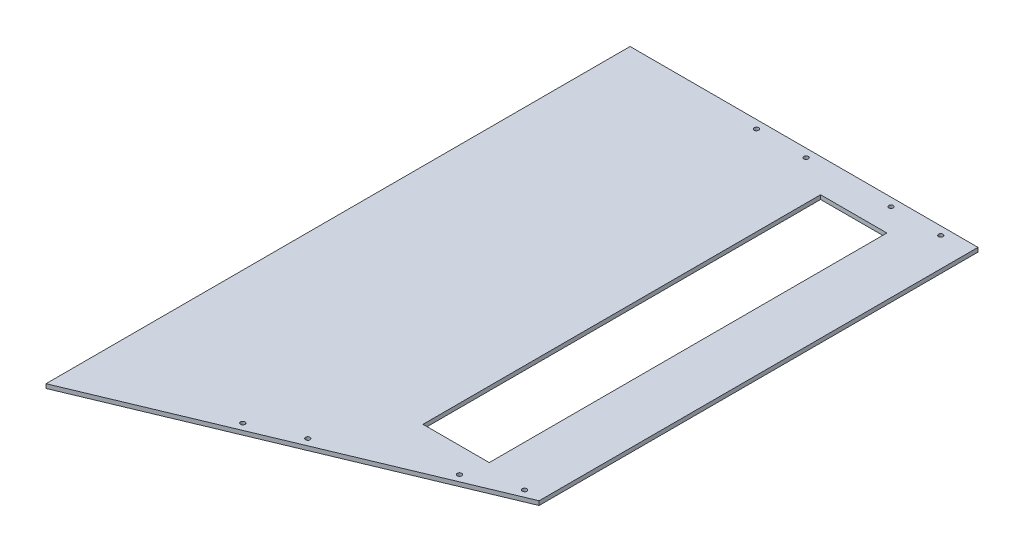
ISO-10303-21;
HEADER;
FILE_DESCRIPTION(('STEP AP214'),'2;1');
FILE_NAME('part.step','',(''),(''),'','','');
FILE_SCHEMA(('AUTOMOTIVE_DESIGN { 1 0 10303 214 1 1 1 1 }'));
ENDSEC;
DATA;
#1=APPLICATION_CONTEXT('core data for automotive mechanical design processes');
#2=APPLICATION_PROTOCOL_DEFINITION('international standard','automotive_design',2000,#1);
#3=PRODUCT_CONTEXT('',#1,'mechanical');
#4=PRODUCT('Part','Part','',(#3));
#5=PRODUCT_RELATED_PRODUCT_CATEGORY('part','',(#4));
#6=PRODUCT_DEFINITION_FORMATION('','',#4);
#7=PRODUCT_DEFINITION_CONTEXT('part definition',#1,'design');
#8=PRODUCT_DEFINITION('design','',#6,#7);
#9=PRODUCT_DEFINITION_SHAPE('','',#8);
#10=(LENGTH_UNIT() NAMED_UNIT(*) SI_UNIT(.MILLI.,.METRE.));
#11=(NAMED_UNIT(*) PLANE_ANGLE_UNIT() SI_UNIT($,.RADIAN.));
#12=(NAMED_UNIT(*) SI_UNIT($,.STERADIAN.) SOLID_ANGLE_UNIT());
#13=UNCERTAINTY_MEASURE_WITH_UNIT(LENGTH_MEASURE(1.E-05),#10,'distance_accuracy_value','');
#14=(GEOMETRIC_REPRESENTATION_CONTEXT(3) GLOBAL_UNCERTAINTY_ASSIGNED_CONTEXT((#13)) GLOBAL_UNIT_ASSIGNED_CONTEXT((#10,
#11,#12)) REPRESENTATION_CONTEXT('',''));
#15=CARTESIAN_POINT('',(0.,0.,0.));
#16=DIRECTION('',(0.,0.,1.));
#17=DIRECTION('',(1.,0.,0.));
#18=AXIS2_PLACEMENT_3D('',#15,#16,#17);
#19=CARTESIAN_POINT('',(0.,-6.35,831.85));
#20=DIRECTION('',(0.,1.,0.));
#21=DIRECTION('',(0.,0.,1.));
#22=AXIS2_PLACEMENT_3D('',#19,#20,#21);
#23=PLANE('',#22);
#24=DIRECTION('',(1.,0.,0.));
#25=VECTOR('',#24,1.);
#26=CARTESIAN_POINT('',(292.1,-6.35,660.4));
#27=LINE('',#26,#25);
#28=CARTESIAN_POINT('',(190.5,-6.35,660.4));
#29=VERTEX_POINT('',#28);
#30=CARTESIAN_POINT('',(292.1,-6.35,660.4));
#31=VERTEX_POINT('',#30);
#32=EDGE_CURVE('E153',#29,#31,#27,.T.);
#33=ORIENTED_EDGE('',*,*,#32,.T.);
#34=DIRECTION('',(0.,0.,-1.));
#35=VECTOR('',#34,1.);
#36=CARTESIAN_POINT('',(292.1,-6.35,50.8));
#37=LINE('',#36,#35);
#38=CARTESIAN_POINT('',(292.1,-6.35,50.8));
#39=VERTEX_POINT('',#38);
#40=EDGE_CURVE('E145',#31,#39,#37,.T.);
#41=ORIENTED_EDGE('',*,*,#40,.T.);
#42=DIRECTION('',(-1.,0.,0.));
#43=VECTOR('',#42,1.);
#44=CARTESIAN_POINT('',(292.1,-6.35,50.8));
#45=LINE('',#44,#43);
#46=CARTESIAN_POINT('',(190.5,-6.35,50.8));
#47=VERTEX_POINT('',#46);
#48=EDGE_CURVE('E148',#39,#47,#45,.T.);
#49=ORIENTED_EDGE('',*,*,#48,.T.);
#50=DIRECTION('',(0.,0.,1.));
#51=VECTOR('',#50,1.);
#52=CARTESIAN_POINT('',(190.5,-6.35,50.8));
#53=LINE('',#52,#51);
#54=EDGE_CURVE('E67',#47,#29,#53,.T.);
#55=ORIENTED_EDGE('',*,*,#54,.T.);
#56=EDGE_LOOP('',(#33,#41,#49,#55));
#57=FACE_BOUND('',#56,.T.);
#58=CARTESIAN_POINT('',(50.8,-6.35,796.892712953548));
#59=DIRECTION('',(0.,1.,0.));
#60=DIRECTION('',(0.,0.,1.));
#61=AXIS2_PLACEMENT_3D('',#58,#59,#60);
#62=CIRCLE('',#61,3.42899999999999);
#63=CARTESIAN_POINT('',(50.8,-6.35,800.321712953548));
#64=VERTEX_POINT('',#63);
#65=EDGE_CURVE('E174',#64,#64,#62,.T.);
#66=ORIENTED_EDGE('',*,*,#65,.T.);
#67=EDGE_LOOP('',(#66));
#68=FACE_BOUND('',#67,.T.);
#69=CARTESIAN_POINT('',(336.55,-6.35,12.7));
#70=DIRECTION('',(0.,1.,0.));
#71=DIRECTION('',(0.,0.,1.));
#72=AXIS2_PLACEMENT_3D('',#69,#70,#71);
#73=CIRCLE('',#72,3.429);
#74=CARTESIAN_POINT('',(336.55,-6.35,16.129));
#75=VERTEX_POINT('',#74);
#76=EDGE_CURVE('E182',#75,#75,#73,.T.);
#77=ORIENTED_EDGE('',*,*,#76,.T.);
#78=EDGE_LOOP('',(#77));
#79=FACE_BOUND('',#78,.T.);
#80=CARTESIAN_POINT('',(260.35,-6.35,12.7));
#81=DIRECTION('',(0.,1.,0.));
#82=DIRECTION('',(0.,0.,1.));
#83=AXIS2_PLACEMENT_3D('',#80,#81,#82);
#84=CIRCLE('',#83,3.429);
#85=CARTESIAN_POINT('',(260.35,-6.35,16.129));
#86=VERTEX_POINT('',#85);
#87=EDGE_CURVE('E205',#86,#86,#84,.T.);
#88=ORIENTED_EDGE('',*,*,#87,.T.);
#89=EDGE_LOOP('',(#88));
#90=FACE_BOUND('',#89,.T.);
#91=CARTESIAN_POINT('',(355.537234944741,-6.35,669.742181542022));
#92=DIRECTION('',(0.,1.,0.));
#93=DIRECTION('',(0.,0.,1.));
#94=AXIS2_PLACEMENT_3D('',#91,#92,#93);
#95=CIRCLE('',#94,3.429);
#96=CARTESIAN_POINT('',(355.537234944741,-6.35,673.171181542022));
#97=VERTEX_POINT('',#96);
#98=EDGE_CURVE('E199',#97,#97,#95,.T.);
#99=ORIENTED_EDGE('',*,*,#98,.T.);
#100=EDGE_LOOP('',(#99));
#101=FACE_BOUND('',#100,.T.);
#102=CARTESIAN_POINT('',(285.213257649801,-6.35,699.084611867759));
#103=DIRECTION('',(0.,1.,0.));
#104=DIRECTION('',(0.,0.,1.));
#105=AXIS2_PLACEMENT_3D('',#102,#103,#104);
#106=CIRCLE('',#105,3.429);
#107=CARTESIAN_POINT('',(285.213257649801,-6.35,702.513611867759));
#108=VERTEX_POINT('',#107);
#109=EDGE_CURVE('E193',#108,#108,#106,.T.);
#110=ORIENTED_EDGE('',*,*,#109,.T.);
#111=EDGE_LOOP('',(#110));
#112=FACE_BOUND('',#111,.T.);
#113=CARTESIAN_POINT('',(121.12397729494,-6.35,767.550282627811));
#114=DIRECTION('',(0.,1.,0.));
#115=DIRECTION('',(0.,0.,1.));
#116=AXIS2_PLACEMENT_3D('',#113,#114,#115);
#117=CIRCLE('',#116,3.429);
#118=CARTESIAN_POINT('',(121.12397729494,-6.35,770.979282627811));
#119=VERTEX_POINT('',#118);
#120=EDGE_CURVE('E181',#119,#119,#117,.T.);
#121=ORIENTED_EDGE('',*,*,#120,.T.);
#122=EDGE_LOOP('',(#121));
#123=FACE_BOUND('',#122,.T.);
#124=CARTESIAN_POINT('',(130.175,-6.35,12.7));
#125=DIRECTION('',(0.,1.,0.));
#126=DIRECTION('',(0.,0.,1.));
#127=AXIS2_PLACEMENT_3D('',#124,#125,#126);
#128=CIRCLE('',#127,3.429);
#129=CARTESIAN_POINT('',(130.175,-6.35,16.129));
#130=VERTEX_POINT('',#129);
#131=EDGE_CURVE('E210',#130,#130,#128,.T.);
#132=ORIENTED_EDGE('',*,*,#131,.T.);
#133=EDGE_LOOP('',(#132));
#134=FACE_BOUND('',#133,.T.);
#135=CARTESIAN_POINT('',(53.975,-6.35,12.7));
#136=DIRECTION('',(0.,1.,0.));
#137=DIRECTION('',(0.,0.,1.));
#138=AXIS2_PLACEMENT_3D('',#135,#136,#137);
#139=CIRCLE('',#138,3.429);
#140=CARTESIAN_POINT('',(53.975,-6.35,16.129));
#141=VERTEX_POINT('',#140);
#142=EDGE_CURVE('E216',#141,#141,#139,.T.);
#143=ORIENTED_EDGE('',*,*,#142,.T.);
#144=EDGE_LOOP('',(#143));
#145=FACE_BOUND('',#144,.T.);
#146=DIRECTION('',(-0.92288684114095,0.,0.38507126411728));
#147=VECTOR('',#146,1.);
#148=CARTESIAN_POINT('',(381.,-6.35,672.879100114478));
#149=LINE('',#148,#147);
#150=CARTESIAN_POINT('',(381.,-6.35,672.879100114478));
#151=VERTEX_POINT('',#150);
#152=CARTESIAN_POINT('',(-152.4,-6.35,895.438359954209));
#153=VERTEX_POINT('',#152);
#154=EDGE_CURVE('E139',#151,#153,#149,.T.);
#155=ORIENTED_EDGE('',*,*,#154,.T.);
#156=DIRECTION('',(0.,0.,1.));
#157=VECTOR('',#156,1.);
#158=CARTESIAN_POINT('',(-152.4,-6.35,895.438359954209));
#159=LINE('',#158,#157);
#160=CARTESIAN_POINT('',(-152.4,-6.35,0.));
#161=VERTEX_POINT('',#160);
#162=EDGE_CURVE('E134',#161,#153,#159,.T.);
#163=ORIENTED_EDGE('',*,*,#162,.F.);
#164=DIRECTION('',(1.,0.,0.));
#165=VECTOR('',#164,1.);
#166=CARTESIAN_POINT('',(0.,-6.35,0.));
#167=LINE('',#166,#165);
#168=CARTESIAN_POINT('',(381.,-6.35,0.));
#169=VERTEX_POINT('',#168);
#170=EDGE_CURVE('E117',#161,#169,#167,.T.);
#171=ORIENTED_EDGE('',*,*,#170,.T.);
#172=DIRECTION('',(0.,0.,-1.));
#173=VECTOR('',#172,1.);
#174=CARTESIAN_POINT('',(381.,-6.35,831.85));
#175=LINE('',#174,#173);
#176=EDGE_CURVE('E13',#151,#169,#175,.T.);
#177=ORIENTED_EDGE('',*,*,#176,.F.);
#178=EDGE_LOOP('',(#155,#163,#171,#177));
#179=FACE_BOUND('',#178,.T.);
#180=ADVANCED_FACE('F53',(#57,#68,#79,#90,#101,#112,#123,#134,#145,#179),#23,.F.);
#181=CARTESIAN_POINT('',(381.,0.,831.85));
#182=DIRECTION('',(1.,0.,0.));
#183=DIRECTION('',(0.,0.,-1.));
#184=AXIS2_PLACEMENT_3D('',#181,#182,#183);
#185=PLANE('',#184);
#186=DIRECTION('',(0.,0.,-1.));
#187=VECTOR('',#186,1.);
#188=CARTESIAN_POINT('',(381.,0.,831.85));
#189=LINE('',#188,#187);
#190=CARTESIAN_POINT('',(381.,0.,672.879100114478));
#191=VERTEX_POINT('',#190);
#192=CARTESIAN_POINT('',(381.,0.,0.));
#193=VERTEX_POINT('',#192);
#194=EDGE_CURVE('E60',#191,#193,#189,.T.);
#195=ORIENTED_EDGE('',*,*,#194,.F.);
#196=DIRECTION('',(0.,-1.,0.));
#197=VECTOR('',#196,1.);
#198=CARTESIAN_POINT('',(381.,1.2E-05,672.879100114478));
#199=LINE('',#198,#197);
#200=EDGE_CURVE('E222',#191,#151,#199,.T.);
#201=ORIENTED_EDGE('',*,*,#200,.T.);
#202=ORIENTED_EDGE('',*,*,#176,.T.);
#203=DIRECTION('',(0.,-1.,0.));
#204=VECTOR('',#203,1.);
#205=CARTESIAN_POINT('',(381.,0.,0.));
#206=LINE('',#205,#204);
#207=EDGE_CURVE('E124',#193,#169,#206,.T.);
#208=ORIENTED_EDGE('',*,*,#207,.F.);
#209=EDGE_LOOP('',(#195,#201,#202,#208));
#210=FACE_BOUND('',#209,.T.);
#211=ADVANCED_FACE('F235',(#210),#185,.T.);
#212=CARTESIAN_POINT('',(0.,0.,831.85));
#213=DIRECTION('',(0.,1.,0.));
#214=DIRECTION('',(0.,0.,1.));
#215=AXIS2_PLACEMENT_3D('',#212,#213,#214);
#216=PLANE('',#215);
#217=DIRECTION('',(0.,0.,-1.));
#218=VECTOR('',#217,1.);
#219=CARTESIAN_POINT('',(292.1,0.,50.8));
#220=LINE('',#219,#218);
#221=CARTESIAN_POINT('',(292.1,0.,660.4));
#222=VERTEX_POINT('',#221);
#223=CARTESIAN_POINT('',(292.1,0.,50.8));
#224=VERTEX_POINT('',#223);
#225=EDGE_CURVE('E75',#222,#224,#220,.T.);
#226=ORIENTED_EDGE('',*,*,#225,.F.);
#227=DIRECTION('',(1.,0.,0.));
#228=VECTOR('',#227,1.);
#229=CARTESIAN_POINT('',(292.1,0.,660.4));
#230=LINE('',#229,#228);
#231=CARTESIAN_POINT('',(190.5,0.,660.4));
#232=VERTEX_POINT('',#231);
#233=EDGE_CURVE('E149',#232,#222,#230,.T.);
#234=ORIENTED_EDGE('',*,*,#233,.F.);
#235=DIRECTION('',(0.,0.,1.));
#236=VECTOR('',#235,1.);
#237=CARTESIAN_POINT('',(190.5,0.,50.8));
#238=LINE('',#237,#236);
#239=CARTESIAN_POINT('',(190.5,0.,50.8));
#240=VERTEX_POINT('',#239);
#241=EDGE_CURVE('E161',#240,#232,#238,.T.);
#242=ORIENTED_EDGE('',*,*,#241,.F.);
#243=DIRECTION('',(-1.,0.,0.));
#244=VECTOR('',#243,1.);
#245=CARTESIAN_POINT('',(292.1,0.,50.8));
#246=LINE('',#245,#244);
#247=EDGE_CURVE('E158',#224,#240,#246,.T.);
#248=ORIENTED_EDGE('',*,*,#247,.F.);
#249=EDGE_LOOP('',(#226,#234,#242,#248));
#250=FACE_BOUND('',#249,.T.);
#251=CARTESIAN_POINT('',(50.8,0.,796.892712953548));
#252=DIRECTION('',(0.,1.,0.));
#253=DIRECTION('',(0.,0.,1.));
#254=AXIS2_PLACEMENT_3D('',#251,#252,#253);
#255=CIRCLE('',#254,3.42899999999999);
#256=CARTESIAN_POINT('',(50.8,0.,800.321712953548));
#257=VERTEX_POINT('',#256);
#258=EDGE_CURVE('E178',#257,#257,#255,.T.);
#259=ORIENTED_EDGE('',*,*,#258,.F.);
#260=EDGE_LOOP('',(#259));
#261=FACE_BOUND('',#260,.T.);
#262=CARTESIAN_POINT('',(336.55,0.,12.7));
#263=DIRECTION('',(0.,1.,0.));
#264=DIRECTION('',(0.,0.,1.));
#265=AXIS2_PLACEMENT_3D('',#262,#263,#264);
#266=CIRCLE('',#265,3.429);
#267=CARTESIAN_POINT('',(336.55,0.,16.129));
#268=VERTEX_POINT('',#267);
#269=EDGE_CURVE('E168',#268,#268,#266,.T.);
#270=ORIENTED_EDGE('',*,*,#269,.F.);
#271=EDGE_LOOP('',(#270));
#272=FACE_BOUND('',#271,.T.);
#273=CARTESIAN_POINT('',(260.35,0.,12.7));
#274=DIRECTION('',(0.,1.,0.));
#275=DIRECTION('',(0.,0.,1.));
#276=AXIS2_PLACEMENT_3D('',#273,#274,#275);
#277=CIRCLE('',#276,3.429);
#278=CARTESIAN_POINT('',(260.35,0.,16.129));
#279=VERTEX_POINT('',#278);
#280=EDGE_CURVE('E185',#279,#279,#277,.T.);
#281=ORIENTED_EDGE('',*,*,#280,.F.);
#282=EDGE_LOOP('',(#281));
#283=FACE_BOUND('',#282,.T.);
#284=CARTESIAN_POINT('',(355.537234944741,0.,669.742181542022));
#285=DIRECTION('',(0.,1.,0.));
#286=DIRECTION('',(0.,0.,1.));
#287=AXIS2_PLACEMENT_3D('',#284,#285,#286);
#288=CIRCLE('',#287,3.429);
#289=CARTESIAN_POINT('',(355.537234944741,0.,673.171181542022));
#290=VERTEX_POINT('',#289);
#291=EDGE_CURVE('E202',#290,#290,#288,.T.);
#292=ORIENTED_EDGE('',*,*,#291,.F.);
#293=EDGE_LOOP('',(#292));
#294=FACE_BOUND('',#293,.T.);
#295=CARTESIAN_POINT('',(285.213257649801,0.,699.084611867759));
#296=DIRECTION('',(0.,1.,0.));
#297=DIRECTION('',(0.,0.,1.));
#298=AXIS2_PLACEMENT_3D('',#295,#296,#297);
#299=CIRCLE('',#298,3.429);
#300=CARTESIAN_POINT('',(285.213257649801,0.,702.513611867759));
#301=VERTEX_POINT('',#300);
#302=EDGE_CURVE('E196',#301,#301,#299,.T.);
#303=ORIENTED_EDGE('',*,*,#302,.F.);
#304=EDGE_LOOP('',(#303));
#305=FACE_BOUND('',#304,.T.);
#306=CARTESIAN_POINT('',(121.12397729494,0.,767.550282627811));
#307=DIRECTION('',(0.,1.,0.));
#308=DIRECTION('',(0.,0.,1.));
#309=AXIS2_PLACEMENT_3D('',#306,#307,#308);
#310=CIRCLE('',#309,3.429);
#311=CARTESIAN_POINT('',(121.12397729494,0.,770.979282627811));
#312=VERTEX_POINT('',#311);
#313=EDGE_CURVE('E190',#312,#312,#310,.T.);
#314=ORIENTED_EDGE('',*,*,#313,.F.);
#315=EDGE_LOOP('',(#314));
#316=FACE_BOUND('',#315,.T.);
#317=CARTESIAN_POINT('',(130.175,0.,12.7));
#318=DIRECTION('',(0.,1.,0.));
#319=DIRECTION('',(0.,0.,1.));
#320=AXIS2_PLACEMENT_3D('',#317,#318,#319);
#321=CIRCLE('',#320,3.429);
#322=CARTESIAN_POINT('',(130.175,0.,16.129));
#323=VERTEX_POINT('',#322);
#324=EDGE_CURVE('E213',#323,#323,#321,.T.);
#325=ORIENTED_EDGE('',*,*,#324,.F.);
#326=EDGE_LOOP('',(#325));
#327=FACE_BOUND('',#326,.T.);
#328=CARTESIAN_POINT('',(53.975,0.,12.7));
#329=DIRECTION('',(0.,1.,0.));
#330=DIRECTION('',(0.,0.,1.));
#331=AXIS2_PLACEMENT_3D('',#328,#329,#330);
#332=CIRCLE('',#331,3.429);
#333=CARTESIAN_POINT('',(53.975,0.,16.129));
#334=VERTEX_POINT('',#333);
#335=EDGE_CURVE('E177',#334,#334,#332,.T.);
#336=ORIENTED_EDGE('',*,*,#335,.F.);
#337=EDGE_LOOP('',(#336));
#338=FACE_BOUND('',#337,.T.);
#339=DIRECTION('',(1.,0.,0.));
#340=VECTOR('',#339,1.);
#341=CARTESIAN_POINT('',(0.,0.,0.));
#342=LINE('',#341,#340);
#343=CARTESIAN_POINT('',(-152.4,0.,0.));
#344=VERTEX_POINT('',#343);
#345=EDGE_CURVE('E230',#344,#193,#342,.T.);
#346=ORIENTED_EDGE('',*,*,#345,.F.);
#347=DIRECTION('',(0.,0.,1.));
#348=VECTOR('',#347,1.);
#349=CARTESIAN_POINT('',(-152.4,0.,895.438359954209));
#350=LINE('',#349,#348);
#351=CARTESIAN_POINT('',(-152.4,0.,895.438359954209));
#352=VERTEX_POINT('',#351);
#353=EDGE_CURVE('E136',#344,#352,#350,.T.);
#354=ORIENTED_EDGE('',*,*,#353,.T.);
#355=DIRECTION('',(0.922886841140949,0.,-0.38507126411728));
#356=VECTOR('',#355,1.);
#357=CARTESIAN_POINT('',(0.,0.,831.85));
#358=LINE('',#357,#356);
#359=EDGE_CURVE('E128',#352,#191,#358,.T.);
#360=ORIENTED_EDGE('',*,*,#359,.T.);
#361=ORIENTED_EDGE('',*,*,#194,.T.);
#362=EDGE_LOOP('',(#346,#354,#360,#361));
#363=FACE_BOUND('',#362,.T.);
#364=ADVANCED_FACE('F233',(#250,#261,#272,#283,#294,#305,#316,#327,#338,#363),#216,.T.);
#365=CARTESIAN_POINT('',(0.,0.,0.));
#366=DIRECTION('',(0.,0.,-1.));
#367=DIRECTION('',(-1.,0.,0.));
#368=AXIS2_PLACEMENT_3D('',#365,#366,#367);
#369=PLANE('',#368);
#370=ORIENTED_EDGE('',*,*,#170,.F.);
#371=DIRECTION('',(0.,1.,0.));
#372=VECTOR('',#371,1.);
#373=CARTESIAN_POINT('',(-152.4,-6.35,0.));
#374=LINE('',#373,#372);
#375=EDGE_CURVE('E121',#161,#344,#374,.T.);
#376=ORIENTED_EDGE('',*,*,#375,.T.);
#377=ORIENTED_EDGE('',*,*,#345,.T.);
#378=ORIENTED_EDGE('',*,*,#207,.T.);
#379=EDGE_LOOP('',(#370,#376,#377,#378));
#380=FACE_BOUND('',#379,.T.);
#381=ADVANCED_FACE('F119',(#380),#369,.T.);
#382=CARTESIAN_POINT('',(381.,1.2E-05,672.879100114478));
#383=DIRECTION('',(0.38507126411728,0.,0.92288684114095));
#384=DIRECTION('',(0.92288684114095,0.,-0.38507126411728));
#385=AXIS2_PLACEMENT_3D('',#382,#383,#384);
#386=PLANE('',#385);
#387=ORIENTED_EDGE('',*,*,#359,.F.);
#388=DIRECTION('',(0.,1.,0.));
#389=VECTOR('',#388,1.);
#390=CARTESIAN_POINT('',(-152.4,-6.35,895.438359954209));
#391=LINE('',#390,#389);
#392=EDGE_CURVE('E137',#153,#352,#391,.T.);
#393=ORIENTED_EDGE('',*,*,#392,.F.);
#394=ORIENTED_EDGE('',*,*,#154,.F.);
#395=ORIENTED_EDGE('',*,*,#200,.F.);
#396=EDGE_LOOP('',(#387,#393,#394,#395));
#397=FACE_BOUND('',#396,.T.);
#398=ADVANCED_FACE('F237',(#397),#386,.T.);
#399=CARTESIAN_POINT('',(53.975,-6.35,12.7));
#400=DIRECTION('',(0.,1.,0.));
#401=DIRECTION('',(0.,0.,1.));
#402=AXIS2_PLACEMENT_3D('',#399,#400,#401);
#403=CYLINDRICAL_SURFACE('',#402,3.429);
#404=ORIENTED_EDGE('',*,*,#142,.F.);
#405=EDGE_LOOP('',(#404));
#406=FACE_BOUND('',#405,.T.);
#407=ORIENTED_EDGE('',*,*,#335,.T.);
#408=EDGE_LOOP('',(#407));
#409=FACE_BOUND('',#408,.T.);
#410=ADVANCED_FACE('F239',(#406,#409),#403,.F.);
#411=CARTESIAN_POINT('',(130.175,-6.35,12.7));
#412=DIRECTION('',(0.,1.,0.));
#413=DIRECTION('',(0.,0.,1.));
#414=AXIS2_PLACEMENT_3D('',#411,#412,#413);
#415=CYLINDRICAL_SURFACE('',#414,3.429);
#416=ORIENTED_EDGE('',*,*,#131,.F.);
#417=EDGE_LOOP('',(#416));
#418=FACE_BOUND('',#417,.T.);
#419=ORIENTED_EDGE('',*,*,#324,.T.);
#420=EDGE_LOOP('',(#419));
#421=FACE_BOUND('',#420,.T.);
#422=ADVANCED_FACE('F245',(#418,#421),#415,.F.);
#423=CARTESIAN_POINT('',(121.12397729494,-6.35,767.550282627811));
#424=DIRECTION('',(0.,1.,0.));
#425=DIRECTION('',(0.,0.,1.));
#426=AXIS2_PLACEMENT_3D('',#423,#424,#425);
#427=CYLINDRICAL_SURFACE('',#426,3.429);
#428=ORIENTED_EDGE('',*,*,#120,.F.);
#429=EDGE_LOOP('',(#428));
#430=FACE_BOUND('',#429,.T.);
#431=ORIENTED_EDGE('',*,*,#313,.T.);
#432=EDGE_LOOP('',(#431));
#433=FACE_BOUND('',#432,.T.);
#434=ADVANCED_FACE('F297',(#430,#433),#427,.F.);
#435=CARTESIAN_POINT('',(285.213257649801,-6.35,699.084611867759));
#436=DIRECTION('',(0.,1.,0.));
#437=DIRECTION('',(0.,0.,1.));
#438=AXIS2_PLACEMENT_3D('',#435,#436,#437);
#439=CYLINDRICAL_SURFACE('',#438,3.429);
#440=ORIENTED_EDGE('',*,*,#109,.F.);
#441=EDGE_LOOP('',(#440));
#442=FACE_BOUND('',#441,.T.);
#443=ORIENTED_EDGE('',*,*,#302,.T.);
#444=EDGE_LOOP('',(#443));
#445=FACE_BOUND('',#444,.T.);
#446=ADVANCED_FACE('F303',(#442,#445),#439,.F.);
#447=CARTESIAN_POINT('',(355.537234944741,-6.35,669.742181542022));
#448=DIRECTION('',(0.,1.,0.));
#449=DIRECTION('',(0.,0.,1.));
#450=AXIS2_PLACEMENT_3D('',#447,#448,#449);
#451=CYLINDRICAL_SURFACE('',#450,3.429);
#452=ORIENTED_EDGE('',*,*,#98,.F.);
#453=EDGE_LOOP('',(#452));
#454=FACE_BOUND('',#453,.T.);
#455=ORIENTED_EDGE('',*,*,#291,.T.);
#456=EDGE_LOOP('',(#455));
#457=FACE_BOUND('',#456,.T.);
#458=ADVANCED_FACE('F311',(#454,#457),#451,.F.);
#459=CARTESIAN_POINT('',(260.35,-6.35,12.7));
#460=DIRECTION('',(0.,1.,0.));
#461=DIRECTION('',(0.,0.,1.));
#462=AXIS2_PLACEMENT_3D('',#459,#460,#461);
#463=CYLINDRICAL_SURFACE('',#462,3.429);
#464=ORIENTED_EDGE('',*,*,#87,.F.);
#465=EDGE_LOOP('',(#464));
#466=FACE_BOUND('',#465,.T.);
#467=ORIENTED_EDGE('',*,*,#280,.T.);
#468=EDGE_LOOP('',(#467));
#469=FACE_BOUND('',#468,.T.);
#470=ADVANCED_FACE('F307',(#466,#469),#463,.F.);
#471=CARTESIAN_POINT('',(336.55,-6.35,12.7));
#472=DIRECTION('',(0.,1.,0.));
#473=DIRECTION('',(0.,0.,1.));
#474=AXIS2_PLACEMENT_3D('',#471,#472,#473);
#475=CYLINDRICAL_SURFACE('',#474,3.429);
#476=ORIENTED_EDGE('',*,*,#76,.F.);
#477=EDGE_LOOP('',(#476));
#478=FACE_BOUND('',#477,.T.);
#479=ORIENTED_EDGE('',*,*,#269,.T.);
#480=EDGE_LOOP('',(#479));
#481=FACE_BOUND('',#480,.T.);
#482=ADVANCED_FACE('F310',(#478,#481),#475,.F.);
#483=CARTESIAN_POINT('',(50.8,-6.35,796.892712953548));
#484=DIRECTION('',(0.,1.,0.));
#485=DIRECTION('',(0.,0.,1.));
#486=AXIS2_PLACEMENT_3D('',#483,#484,#485);
#487=CYLINDRICAL_SURFACE('',#486,3.42899999999999);
#488=ORIENTED_EDGE('',*,*,#65,.F.);
#489=EDGE_LOOP('',(#488));
#490=FACE_BOUND('',#489,.T.);
#491=ORIENTED_EDGE('',*,*,#258,.T.);
#492=EDGE_LOOP('',(#491));
#493=FACE_BOUND('',#492,.T.);
#494=ADVANCED_FACE('F321',(#490,#493),#487,.F.);
#495=CARTESIAN_POINT('',(292.1,-6.35,50.8));
#496=DIRECTION('',(1.,0.,0.));
#497=DIRECTION('',(0.,0.,-1.));
#498=AXIS2_PLACEMENT_3D('',#495,#496,#497);
#499=PLANE('',#498);
#500=ORIENTED_EDGE('',*,*,#225,.T.);
#501=DIRECTION('',(0.,1.,0.));
#502=VECTOR('',#501,1.);
#503=CARTESIAN_POINT('',(292.1,-6.35,50.8));
#504=LINE('',#503,#502);
#505=EDGE_CURVE('E156',#39,#224,#504,.T.);
#506=ORIENTED_EDGE('',*,*,#505,.F.);
#507=ORIENTED_EDGE('',*,*,#40,.F.);
#508=DIRECTION('',(0.,1.,0.));
#509=VECTOR('',#508,1.);
#510=CARTESIAN_POINT('',(292.1,-6.35,660.4));
#511=LINE('',#510,#509);
#512=EDGE_CURVE('E166',#31,#222,#511,.T.);
#513=ORIENTED_EDGE('',*,*,#512,.T.);
#514=EDGE_LOOP('',(#500,#506,#507,#513));
#515=FACE_BOUND('',#514,.T.);
#516=ADVANCED_FACE('F325',(#515),#499,.F.);
#517=CARTESIAN_POINT('',(292.1,-6.35,660.4));
#518=DIRECTION('',(0.,0.,1.));
#519=DIRECTION('',(1.,0.,0.));
#520=AXIS2_PLACEMENT_3D('',#517,#518,#519);
#521=PLANE('',#520);
#522=ORIENTED_EDGE('',*,*,#233,.T.);
#523=ORIENTED_EDGE('',*,*,#512,.F.);
#524=ORIENTED_EDGE('',*,*,#32,.F.);
#525=DIRECTION('',(0.,1.,0.));
#526=VECTOR('',#525,1.);
#527=CARTESIAN_POINT('',(190.5,-6.35,660.4));
#528=LINE('',#527,#526);
#529=EDGE_CURVE('E169',#29,#232,#528,.T.);
#530=ORIENTED_EDGE('',*,*,#529,.T.);
#531=EDGE_LOOP('',(#522,#523,#524,#530));
#532=FACE_BOUND('',#531,.T.);
#533=ADVANCED_FACE('F329',(#532),#521,.F.);
#534=CARTESIAN_POINT('',(190.5,-6.35,50.8));
#535=DIRECTION('',(-1.,0.,0.));
#536=DIRECTION('',(0.,0.,1.));
#537=AXIS2_PLACEMENT_3D('',#534,#535,#536);
#538=PLANE('',#537);
#539=ORIENTED_EDGE('',*,*,#241,.T.);
#540=ORIENTED_EDGE('',*,*,#529,.F.);
#541=ORIENTED_EDGE('',*,*,#54,.F.);
#542=DIRECTION('',(0.,1.,0.));
#543=VECTOR('',#542,1.);
#544=CARTESIAN_POINT('',(190.5,-6.35,50.8));
#545=LINE('',#544,#543);
#546=EDGE_CURVE('E171',#47,#240,#545,.T.);
#547=ORIENTED_EDGE('',*,*,#546,.T.);
#548=EDGE_LOOP('',(#539,#540,#541,#547));
#549=FACE_BOUND('',#548,.T.);
#550=ADVANCED_FACE('F333',(#549),#538,.F.);
#551=CARTESIAN_POINT('',(292.1,-6.35,50.8));
#552=DIRECTION('',(0.,0.,-1.));
#553=DIRECTION('',(-1.,0.,0.));
#554=AXIS2_PLACEMENT_3D('',#551,#552,#553);
#555=PLANE('',#554);
#556=ORIENTED_EDGE('',*,*,#247,.T.);
#557=ORIENTED_EDGE('',*,*,#546,.F.);
#558=ORIENTED_EDGE('',*,*,#48,.F.);
#559=ORIENTED_EDGE('',*,*,#505,.T.);
#560=EDGE_LOOP('',(#556,#557,#558,#559));
#561=FACE_BOUND('',#560,.T.);
#562=ADVANCED_FACE('F330',(#561),#555,.F.);
#563=CARTESIAN_POINT('',(-152.4,-6.35,895.438359954209));
#564=DIRECTION('',(-1.,0.,0.));
#565=DIRECTION('',(0.,0.,1.));
#566=AXIS2_PLACEMENT_3D('',#563,#564,#565);
#567=PLANE('',#566);
#568=ORIENTED_EDGE('',*,*,#353,.F.);
#569=ORIENTED_EDGE('',*,*,#375,.F.);
#570=ORIENTED_EDGE('',*,*,#162,.T.);
#571=ORIENTED_EDGE('',*,*,#392,.T.);
#572=EDGE_LOOP('',(#568,#569,#570,#571));
#573=FACE_BOUND('',#572,.T.);
#574=ADVANCED_FACE('F132',(#573),#567,.T.);
#575=CLOSED_SHELL('',(#180,#211,#364,#381,#398,#410,#422,#434,#446,#458,#470,#482,#494,#516,
#533,#550,#562,#574));
#576=MANIFOLD_SOLID_BREP('B2',#575);
#577=ADVANCED_BREP_SHAPE_REPRESENTATION('',(#18,#576),#14);
#578=SHAPE_DEFINITION_REPRESENTATION(#9,#577);
ENDSEC;
END-ISO-10303-21;
